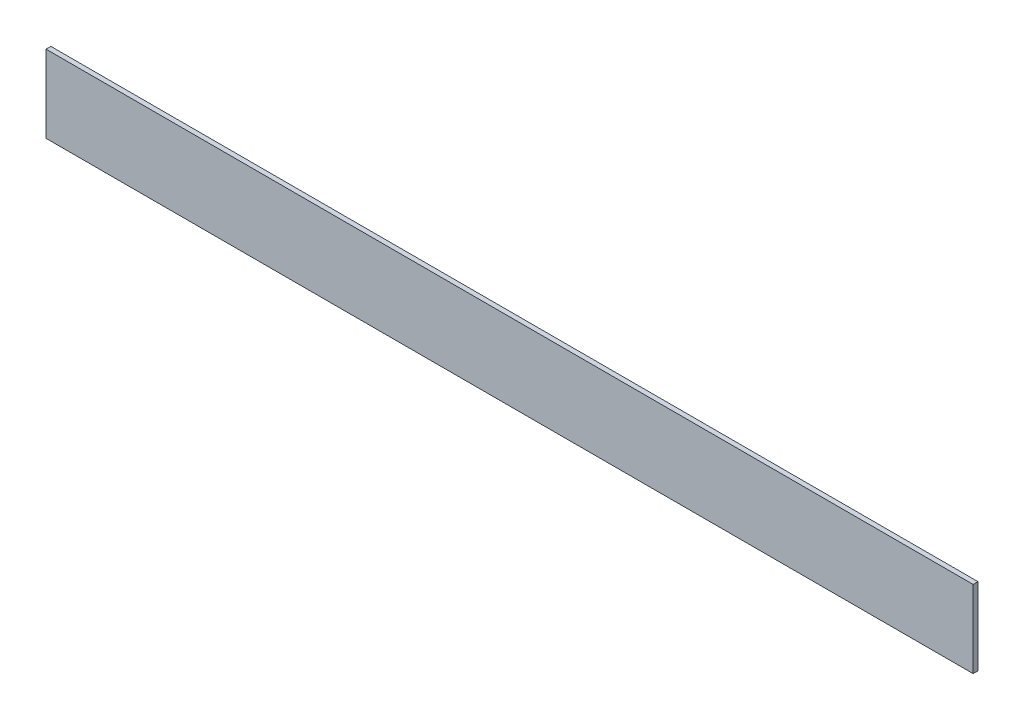
ISO-10303-21;
HEADER;
FILE_DESCRIPTION(('STEP AP214'),'2;1');
FILE_NAME('part.step','',(''),(''),'','','');
FILE_SCHEMA(('AUTOMOTIVE_DESIGN { 1 0 10303 214 1 1 1 1 }'));
ENDSEC;
DATA;
#1=APPLICATION_CONTEXT('core data for automotive mechanical design processes');
#2=APPLICATION_PROTOCOL_DEFINITION('international standard','automotive_design',2000,#1);
#3=PRODUCT_CONTEXT('',#1,'mechanical');
#4=PRODUCT('Part','Part','',(#3));
#5=PRODUCT_RELATED_PRODUCT_CATEGORY('part','',(#4));
#6=PRODUCT_DEFINITION_FORMATION('','',#4);
#7=PRODUCT_DEFINITION_CONTEXT('part definition',#1,'design');
#8=PRODUCT_DEFINITION('design','',#6,#7);
#9=PRODUCT_DEFINITION_SHAPE('','',#8);
#10=(LENGTH_UNIT() NAMED_UNIT(*) SI_UNIT(.MILLI.,.METRE.));
#11=(NAMED_UNIT(*) PLANE_ANGLE_UNIT() SI_UNIT($,.RADIAN.));
#12=(NAMED_UNIT(*) SI_UNIT($,.STERADIAN.) SOLID_ANGLE_UNIT());
#13=UNCERTAINTY_MEASURE_WITH_UNIT(LENGTH_MEASURE(1.E-05),#10,'distance_accuracy_value','');
#14=(GEOMETRIC_REPRESENTATION_CONTEXT(3) GLOBAL_UNCERTAINTY_ASSIGNED_CONTEXT((#13)) GLOBAL_UNIT_ASSIGNED_CONTEXT((#10,
#11,#12)) REPRESENTATION_CONTEXT('',''));
#15=CARTESIAN_POINT('',(0.,0.,0.));
#16=DIRECTION('',(0.,0.,1.));
#17=DIRECTION('',(1.,0.,0.));
#18=AXIS2_PLACEMENT_3D('',#15,#16,#17);
#19=CARTESIAN_POINT('',(304.8,25.4,3.175));
#20=DIRECTION('',(-1.,0.,0.));
#21=DIRECTION('',(0.,0.,1.));
#22=AXIS2_PLACEMENT_3D('',#19,#20,#21);
#23=PLANE('',#22);
#24=DIRECTION('',(0.,1.,0.));
#25=VECTOR('',#24,1.);
#26=CARTESIAN_POINT('',(304.8,25.4,0.));
#27=LINE('',#26,#25);
#28=CARTESIAN_POINT('',(304.8,-25.4,0.));
#29=VERTEX_POINT('',#28);
#30=CARTESIAN_POINT('',(304.8,25.4,0.));
#31=VERTEX_POINT('',#30);
#32=EDGE_CURVE('E94',#29,#31,#27,.T.);
#33=ORIENTED_EDGE('',*,*,#32,.T.);
#34=DIRECTION('',(0.,0.,-1.));
#35=VECTOR('',#34,1.);
#36=CARTESIAN_POINT('',(304.8,25.4,3.175));
#37=LINE('',#36,#35);
#38=CARTESIAN_POINT('',(304.8,25.4,3.175));
#39=VERTEX_POINT('',#38);
#40=EDGE_CURVE('E11',#39,#31,#37,.T.);
#41=ORIENTED_EDGE('',*,*,#40,.F.);
#42=DIRECTION('',(0.,1.,0.));
#43=VECTOR('',#42,1.);
#44=CARTESIAN_POINT('',(304.8,25.4,3.175));
#45=LINE('',#44,#43);
#46=CARTESIAN_POINT('',(304.8,-25.4,3.175));
#47=VERTEX_POINT('',#46);
#48=EDGE_CURVE('E82',#47,#39,#45,.T.);
#49=ORIENTED_EDGE('',*,*,#48,.F.);
#50=DIRECTION('',(0.,0.,-1.));
#51=VECTOR('',#50,1.);
#52=CARTESIAN_POINT('',(304.8,-25.4,3.175));
#53=LINE('',#52,#51);
#54=EDGE_CURVE('E90',#47,#29,#53,.T.);
#55=ORIENTED_EDGE('',*,*,#54,.T.);
#56=EDGE_LOOP('',(#33,#41,#49,#55));
#57=FACE_BOUND('',#56,.T.);
#58=ADVANCED_FACE('F31',(#57),#23,.F.);
#59=CARTESIAN_POINT('',(-304.8,25.4,3.175));
#60=DIRECTION('',(0.,-1.,0.));
#61=DIRECTION('',(0.,0.,-1.));
#62=AXIS2_PLACEMENT_3D('',#59,#60,#61);
#63=PLANE('',#62);
#64=DIRECTION('',(-1.,0.,0.));
#65=VECTOR('',#64,1.);
#66=CARTESIAN_POINT('',(-304.8,25.4,0.));
#67=LINE('',#66,#65);
#68=CARTESIAN_POINT('',(-304.8,25.4,0.));
#69=VERTEX_POINT('',#68);
#70=EDGE_CURVE('E86',#31,#69,#67,.T.);
#71=ORIENTED_EDGE('',*,*,#70,.T.);
#72=DIRECTION('',(0.,0.,-1.));
#73=VECTOR('',#72,1.);
#74=CARTESIAN_POINT('',(-304.8,25.4,3.175));
#75=LINE('',#74,#73);
#76=CARTESIAN_POINT('',(-304.8,25.4,3.175));
#77=VERTEX_POINT('',#76);
#78=EDGE_CURVE('E39',#77,#69,#75,.T.);
#79=ORIENTED_EDGE('',*,*,#78,.F.);
#80=DIRECTION('',(-1.,0.,0.));
#81=VECTOR('',#80,1.);
#82=CARTESIAN_POINT('',(-304.8,25.4,3.175));
#83=LINE('',#82,#81);
#84=EDGE_CURVE('E77',#39,#77,#83,.T.);
#85=ORIENTED_EDGE('',*,*,#84,.F.);
#86=ORIENTED_EDGE('',*,*,#40,.T.);
#87=EDGE_LOOP('',(#71,#79,#85,#86));
#88=FACE_BOUND('',#87,.T.);
#89=ADVANCED_FACE('F85',(#88),#63,.F.);
#90=CARTESIAN_POINT('',(-304.8,25.4,3.175));
#91=DIRECTION('',(1.,0.,0.));
#92=DIRECTION('',(0.,0.,-1.));
#93=AXIS2_PLACEMENT_3D('',#90,#91,#92);
#94=PLANE('',#93);
#95=DIRECTION('',(0.,-1.,0.));
#96=VECTOR('',#95,1.);
#97=CARTESIAN_POINT('',(-304.8,25.4,0.));
#98=LINE('',#97,#96);
#99=CARTESIAN_POINT('',(-304.8,-25.4,0.));
#100=VERTEX_POINT('',#99);
#101=EDGE_CURVE('E64',#69,#100,#98,.T.);
#102=ORIENTED_EDGE('',*,*,#101,.T.);
#103=DIRECTION('',(0.,0.,-1.));
#104=VECTOR('',#103,1.);
#105=CARTESIAN_POINT('',(-304.8,-25.4,3.175));
#106=LINE('',#105,#104);
#107=CARTESIAN_POINT('',(-304.8,-25.4,3.175));
#108=VERTEX_POINT('',#107);
#109=EDGE_CURVE('E87',#108,#100,#106,.T.);
#110=ORIENTED_EDGE('',*,*,#109,.F.);
#111=DIRECTION('',(0.,-1.,0.));
#112=VECTOR('',#111,1.);
#113=CARTESIAN_POINT('',(-304.8,25.4,3.175));
#114=LINE('',#113,#112);
#115=EDGE_CURVE('E80',#77,#108,#114,.T.);
#116=ORIENTED_EDGE('',*,*,#115,.F.);
#117=ORIENTED_EDGE('',*,*,#78,.T.);
#118=EDGE_LOOP('',(#102,#110,#116,#117));
#119=FACE_BOUND('',#118,.T.);
#120=ADVANCED_FACE('F88',(#119),#94,.F.);
#121=CARTESIAN_POINT('',(-304.8,-25.4,3.175));
#122=DIRECTION('',(0.,1.,0.));
#123=DIRECTION('',(0.,0.,1.));
#124=AXIS2_PLACEMENT_3D('',#121,#122,#123);
#125=PLANE('',#124);
#126=DIRECTION('',(1.,0.,0.));
#127=VECTOR('',#126,1.);
#128=CARTESIAN_POINT('',(-304.8,-25.4,0.));
#129=LINE('',#128,#127);
#130=EDGE_CURVE('E70',#100,#29,#129,.T.);
#131=ORIENTED_EDGE('',*,*,#130,.T.);
#132=ORIENTED_EDGE('',*,*,#54,.F.);
#133=DIRECTION('',(1.,0.,0.));
#134=VECTOR('',#133,1.);
#135=CARTESIAN_POINT('',(-304.8,-25.4,3.175));
#136=LINE('',#135,#134);
#137=EDGE_CURVE('E47',#108,#47,#136,.T.);
#138=ORIENTED_EDGE('',*,*,#137,.F.);
#139=ORIENTED_EDGE('',*,*,#109,.T.);
#140=EDGE_LOOP('',(#131,#132,#138,#139));
#141=FACE_BOUND('',#140,.T.);
#142=ADVANCED_FACE('F101',(#141),#125,.F.);
#143=CARTESIAN_POINT('',(304.8,-25.4,3.175));
#144=DIRECTION('',(0.,0.,1.));
#145=DIRECTION('',(1.,0.,0.));
#146=AXIS2_PLACEMENT_3D('',#143,#144,#145);
#147=PLANE('',#146);
#148=ORIENTED_EDGE('',*,*,#48,.T.);
#149=ORIENTED_EDGE('',*,*,#84,.T.);
#150=ORIENTED_EDGE('',*,*,#115,.T.);
#151=ORIENTED_EDGE('',*,*,#137,.T.);
#152=EDGE_LOOP('',(#148,#149,#150,#151));
#153=FACE_BOUND('',#152,.T.);
#154=ADVANCED_FACE('F78',(#153),#147,.T.);
#155=CARTESIAN_POINT('',(304.8,-25.4,0.));
#156=DIRECTION('',(0.,0.,1.));
#157=DIRECTION('',(1.,0.,0.));
#158=AXIS2_PLACEMENT_3D('',#155,#156,#157);
#159=PLANE('',#158);
#160=ORIENTED_EDGE('',*,*,#32,.F.);
#161=ORIENTED_EDGE('',*,*,#130,.F.);
#162=ORIENTED_EDGE('',*,*,#101,.F.);
#163=ORIENTED_EDGE('',*,*,#70,.F.);
#164=EDGE_LOOP('',(#160,#161,#162,#163));
#165=FACE_BOUND('',#164,.T.);
#166=ADVANCED_FACE('F104',(#165),#159,.F.);
#167=CLOSED_SHELL('',(#58,#89,#120,#142,#154,#166));
#168=MANIFOLD_SOLID_BREP('B2',#167);
#169=ADVANCED_BREP_SHAPE_REPRESENTATION('',(#18,#168),#14);
#170=SHAPE_DEFINITION_REPRESENTATION(#9,#169);
ENDSEC;
END-ISO-10303-21;
